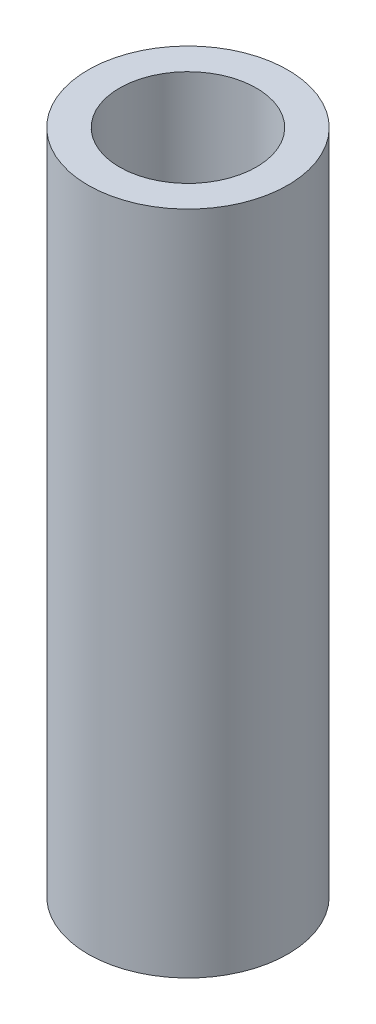
ISO-10303-21;
HEADER;
FILE_DESCRIPTION(('STEP AP214'),'2;1');
FILE_NAME('part.step','',(''),(''),'','','');
FILE_SCHEMA(('AUTOMOTIVE_DESIGN { 1 0 10303 214 1 1 1 1 }'));
ENDSEC;
DATA;
#1=APPLICATION_CONTEXT('core data for automotive mechanical design processes');
#2=APPLICATION_PROTOCOL_DEFINITION('international standard','automotive_design',2000,#1);
#3=PRODUCT_CONTEXT('',#1,'mechanical');
#4=PRODUCT('Part','Part','',(#3));
#5=PRODUCT_RELATED_PRODUCT_CATEGORY('part','',(#4));
#6=PRODUCT_DEFINITION_FORMATION('','',#4);
#7=PRODUCT_DEFINITION_CONTEXT('part definition',#1,'design');
#8=PRODUCT_DEFINITION('design','',#6,#7);
#9=PRODUCT_DEFINITION_SHAPE('','',#8);
#10=(LENGTH_UNIT() NAMED_UNIT(*) SI_UNIT(.MILLI.,.METRE.));
#11=(NAMED_UNIT(*) PLANE_ANGLE_UNIT() SI_UNIT($,.RADIAN.));
#12=(NAMED_UNIT(*) SI_UNIT($,.STERADIAN.) SOLID_ANGLE_UNIT());
#13=UNCERTAINTY_MEASURE_WITH_UNIT(LENGTH_MEASURE(1.E-05),#10,'distance_accuracy_value','');
#14=(GEOMETRIC_REPRESENTATION_CONTEXT(3) GLOBAL_UNCERTAINTY_ASSIGNED_CONTEXT((#13)) GLOBAL_UNIT_ASSIGNED_CONTEXT((#10,
#11,#12)) REPRESENTATION_CONTEXT('',''));
#15=CARTESIAN_POINT('',(0.,0.,0.));
#16=DIRECTION('',(0.,0.,1.));
#17=DIRECTION('',(1.,0.,0.));
#18=AXIS2_PLACEMENT_3D('',#15,#16,#17);
#19=CARTESIAN_POINT('',(0.,15.875,0.));
#20=DIRECTION('',(0.,-1.,0.));
#21=DIRECTION('',(0.,0.,-1.));
#22=AXIS2_PLACEMENT_3D('',#19,#20,#21);
#23=CYLINDRICAL_SURFACE('',#22,2.38125);
#24=CARTESIAN_POINT('',(0.,15.875,0.));
#25=DIRECTION('',(0.,1.,0.));
#26=DIRECTION('',(0.,0.,1.));
#27=AXIS2_PLACEMENT_3D('',#24,#25,#26);
#28=CIRCLE('',#27,2.38125);
#29=CARTESIAN_POINT('',(0.,15.875,2.38125));
#30=VERTEX_POINT('',#29);
#31=EDGE_CURVE('E11',#30,#30,#28,.T.);
#32=ORIENTED_EDGE('',*,*,#31,.F.);
#33=EDGE_LOOP('',(#32));
#34=FACE_BOUND('',#33,.T.);
#35=CARTESIAN_POINT('',(0.,0.,0.));
#36=DIRECTION('',(0.,1.,0.));
#37=DIRECTION('',(0.,0.,1.));
#38=AXIS2_PLACEMENT_3D('',#35,#36,#37);
#39=CIRCLE('',#38,2.38125);
#40=CARTESIAN_POINT('',(0.,0.,2.38125));
#41=VERTEX_POINT('',#40);
#42=EDGE_CURVE('E36',#41,#41,#39,.T.);
#43=ORIENTED_EDGE('',*,*,#42,.T.);
#44=EDGE_LOOP('',(#43));
#45=FACE_BOUND('',#44,.T.);
#46=ADVANCED_FACE('F33',(#34,#45),#23,.T.);
#47=CARTESIAN_POINT('',(0.,15.875,0.));
#48=DIRECTION('',(0.,1.,0.));
#49=DIRECTION('',(0.,0.,1.));
#50=AXIS2_PLACEMENT_3D('',#47,#48,#49);
#51=PLANE('',#50);
#52=CARTESIAN_POINT('',(0.,15.875,0.));
#53=DIRECTION('',(0.,1.,0.));
#54=DIRECTION('',(0.,0.,1.));
#55=AXIS2_PLACEMENT_3D('',#52,#53,#54);
#56=CIRCLE('',#55,1.63195);
#57=CARTESIAN_POINT('',(0.,15.875,1.63195));
#58=VERTEX_POINT('',#57);
#59=EDGE_CURVE('E52',#58,#58,#56,.T.);
#60=ORIENTED_EDGE('',*,*,#59,.F.);
#61=EDGE_LOOP('',(#60));
#62=FACE_BOUND('',#61,.T.);
#63=ORIENTED_EDGE('',*,*,#31,.T.);
#64=EDGE_LOOP('',(#63));
#65=FACE_BOUND('',#64,.T.);
#66=ADVANCED_FACE('F60',(#62,#65),#51,.T.);
#67=CARTESIAN_POINT('',(0.,0.,0.));
#68=DIRECTION('',(0.,1.,0.));
#69=DIRECTION('',(0.,0.,1.));
#70=AXIS2_PLACEMENT_3D('',#67,#68,#69);
#71=PLANE('',#70);
#72=ORIENTED_EDGE('',*,*,#42,.F.);
#73=EDGE_LOOP('',(#72));
#74=FACE_BOUND('',#73,.T.);
#75=ADVANCED_FACE('F46',(#74),#71,.F.);
#76=CARTESIAN_POINT('',(0.,8.255,0.));
#77=DIRECTION('',(0.,1.,0.));
#78=DIRECTION('',(0.,0.,1.));
#79=AXIS2_PLACEMENT_3D('',#76,#77,#78);
#80=CONICAL_SURFACE('',#79,1.63195,1.02974425867665);
#81=CARTESIAN_POINT('',(0.,7.27442551277797,0.));
#82=VERTEX_POINT('',#81);
#83=VERTEX_LOOP('',#82);
#84=FACE_BOUND('',#83,.T.);
#85=CARTESIAN_POINT('',(0.,8.255,0.));
#86=DIRECTION('',(0.,1.,0.));
#87=DIRECTION('',(0.,0.,1.));
#88=AXIS2_PLACEMENT_3D('',#85,#86,#87);
#89=CIRCLE('',#88,1.63195);
#90=CARTESIAN_POINT('',(0.,8.255,1.63195));
#91=VERTEX_POINT('',#90);
#92=EDGE_CURVE('E50',#91,#91,#89,.T.);
#93=ORIENTED_EDGE('',*,*,#92,.T.);
#94=EDGE_LOOP('',(#93));
#95=FACE_BOUND('',#94,.T.);
#96=ADVANCED_FACE('F42',(#84,#95),#80,.F.);
#97=CARTESIAN_POINT('',(0.,15.875,0.));
#98=DIRECTION('',(0.,1.,0.));
#99=DIRECTION('',(0.,0.,1.));
#100=AXIS2_PLACEMENT_3D('',#97,#98,#99);
#101=CYLINDRICAL_SURFACE('',#100,1.63195);
#102=ORIENTED_EDGE('',*,*,#92,.F.);
#103=EDGE_LOOP('',(#102));
#104=FACE_BOUND('',#103,.T.);
#105=ORIENTED_EDGE('',*,*,#59,.T.);
#106=EDGE_LOOP('',(#105));
#107=FACE_BOUND('',#106,.T.);
#108=ADVANCED_FACE('F45',(#104,#107),#101,.F.);
#109=CLOSED_SHELL('',(#46,#66,#75,#96,#108));
#110=MANIFOLD_SOLID_BREP('B2',#109);
#111=ADVANCED_BREP_SHAPE_REPRESENTATION('',(#18,#110),#14);
#112=SHAPE_DEFINITION_REPRESENTATION(#9,#111);
ENDSEC;
END-ISO-10303-21;
